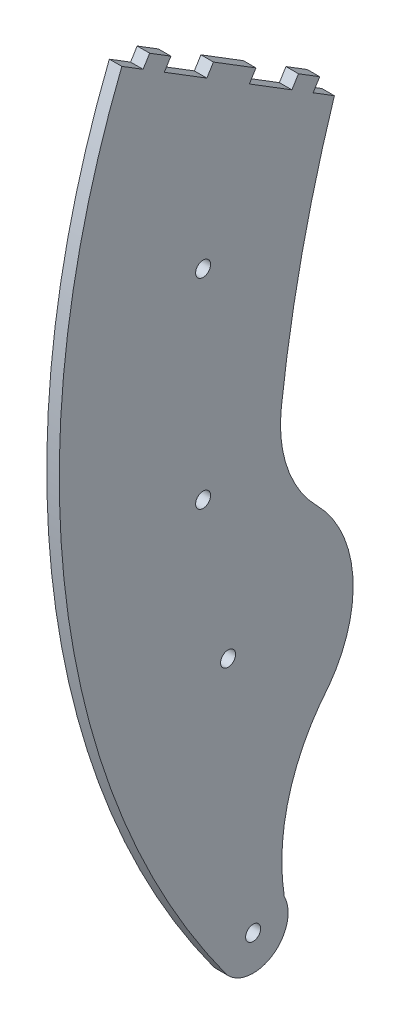
ISO-10303-21;
HEADER;
FILE_DESCRIPTION(('STEP AP214'),'2;1');
FILE_NAME('part.step','',(''),(''),'','','');
FILE_SCHEMA(('AUTOMOTIVE_DESIGN { 1 0 10303 214 1 1 1 1 }'));
ENDSEC;
DATA;
#1=APPLICATION_CONTEXT('core data for automotive mechanical design processes');
#2=APPLICATION_PROTOCOL_DEFINITION('international standard','automotive_design',2000,#1);
#3=PRODUCT_CONTEXT('',#1,'mechanical');
#4=PRODUCT('Part','Part','',(#3));
#5=PRODUCT_RELATED_PRODUCT_CATEGORY('part','',(#4));
#6=PRODUCT_DEFINITION_FORMATION('','',#4);
#7=PRODUCT_DEFINITION_CONTEXT('part definition',#1,'design');
#8=PRODUCT_DEFINITION('design','',#6,#7);
#9=PRODUCT_DEFINITION_SHAPE('','',#8);
#10=(LENGTH_UNIT() NAMED_UNIT(*) SI_UNIT(.MILLI.,.METRE.));
#11=(NAMED_UNIT(*) PLANE_ANGLE_UNIT() SI_UNIT($,.RADIAN.));
#12=(NAMED_UNIT(*) SI_UNIT($,.STERADIAN.) SOLID_ANGLE_UNIT());
#13=UNCERTAINTY_MEASURE_WITH_UNIT(LENGTH_MEASURE(1.E-05),#10,'distance_accuracy_value','');
#14=(GEOMETRIC_REPRESENTATION_CONTEXT(3) GLOBAL_UNCERTAINTY_ASSIGNED_CONTEXT((#13)) GLOBAL_UNIT_ASSIGNED_CONTEXT((#10,
#11,#12)) REPRESENTATION_CONTEXT('',''));
#15=CARTESIAN_POINT('',(0.,0.,0.));
#16=DIRECTION('',(0.,0.,1.));
#17=DIRECTION('',(1.,0.,0.));
#18=AXIS2_PLACEMENT_3D('',#15,#16,#17);
#19=CARTESIAN_POINT('',(2.5,7.3686532794475,-268.81066568157));
#20=DIRECTION('',(1.,0.,0.));
#21=DIRECTION('',(0.,0.,-1.));
#22=AXIS2_PLACEMENT_3D('',#19,#20,#21);
#23=PLANE('',#22);
#24=CARTESIAN_POINT('',(2.5,30.,5.));
#25=DIRECTION('',(1.,0.,0.));
#26=DIRECTION('',(0.,0.,-1.));
#27=AXIS2_PLACEMENT_3D('',#24,#25,#26);
#28=CIRCLE('',#27,1.5);
#29=CARTESIAN_POINT('',(2.5,30.,3.5));
#30=VERTEX_POINT('',#29);
#31=EDGE_CURVE('E382',#30,#30,#28,.T.);
#32=ORIENTED_EDGE('',*,*,#31,.F.);
#33=EDGE_LOOP('',(#32));
#34=FACE_BOUND('',#33,.T.);
#35=CARTESIAN_POINT('',(2.5,-50.,-5.00000000000001));
#36=DIRECTION('',(1.,0.,0.));
#37=DIRECTION('',(0.,0.,-1.));
#38=AXIS2_PLACEMENT_3D('',#35,#36,#37);
#39=CIRCLE('',#38,1.5);
#40=CARTESIAN_POINT('',(2.5,-50.,-6.50000000000001));
#41=VERTEX_POINT('',#40);
#42=EDGE_CURVE('E199',#41,#41,#39,.T.);
#43=ORIENTED_EDGE('',*,*,#42,.F.);
#44=EDGE_LOOP('',(#43));
#45=FACE_BOUND('',#44,.T.);
#46=CARTESIAN_POINT('',(2.5,7.3686532794475,-268.81066568157));
#47=DIRECTION('',(-1.,0.,0.));
#48=DIRECTION('',(0.,0.,-1.));
#49=AXIS2_PLACEMENT_3D('',#46,#47,#48);
#50=CIRCLE('',#49,260.000000000341);
#51=CARTESIAN_POINT('',(2.5,38.2060235623893,-10.6458799453857));
#52=VERTEX_POINT('',#51);
#53=CARTESIAN_POINT('',(2.5,86.8335273900748,-21.2519175372974));
#54=VERTEX_POINT('',#53);
#55=EDGE_CURVE('E232',#52,#54,#50,.T.);
#56=ORIENTED_EDGE('',*,*,#55,.T.);
#57=DIRECTION('',(0.,0.526658904397004,0.850076701491899));
#58=VECTOR('',#57,1.);
#59=CARTESIAN_POINT('',(2.5,86.8335273900748,-21.2519175372974));
#60=LINE('',#59,#58);
#61=CARTESIAN_POINT('',(2.5,89.4668219120599,-17.001534029838));
#62=VERTEX_POINT('',#61);
#63=EDGE_CURVE('E125',#54,#62,#60,.T.);
#64=ORIENTED_EDGE('',*,*,#63,.T.);
#65=DIRECTION('',(0.,0.8500767014919,-0.526658904397003));
#66=VECTOR('',#65,1.);
#67=CARTESIAN_POINT('',(2.5,89.4668219120599,-17.001534029838));
#68=LINE('',#67,#66);
#69=CARTESIAN_POINT('',(2.5,91.5920136657897,-18.3181812908305));
#70=VERTEX_POINT('',#69);
#71=EDGE_CURVE('E280',#62,#70,#68,.T.);
#72=ORIENTED_EDGE('',*,*,#71,.T.);
#73=DIRECTION('',(0.,0.526658904397003,0.8500767014919));
#74=VECTOR('',#73,1.);
#75=CARTESIAN_POINT('',(2.5,94.2253081877747,-14.067797783371));
#76=LINE('',#75,#74);
#77=CARTESIAN_POINT('',(2.5,94.2253081877747,-14.067797783371));
#78=VERTEX_POINT('',#77);
#79=EDGE_CURVE('E299',#70,#78,#76,.T.);
#80=ORIENTED_EDGE('',*,*,#79,.T.);
#81=DIRECTION('',(0.,-0.850076701491899,0.526658904397004));
#82=VECTOR('',#81,1.);
#83=CARTESIAN_POINT('',(2.5,92.1001164340449,-12.7511505223785));
#84=LINE('',#83,#82);
#85=CARTESIAN_POINT('',(2.5,92.1001164340449,-12.7511505223785));
#86=VERTEX_POINT('',#85);
#87=EDGE_CURVE('E296',#78,#86,#84,.T.);
#88=ORIENTED_EDGE('',*,*,#87,.T.);
#89=DIRECTION('',(0.,0.526658904397005,0.850076701491899));
#90=VECTOR('',#89,1.);
#91=CARTESIAN_POINT('',(2.5,97.3667054780149,-4.25038350745946));
#92=LINE('',#91,#90);
#93=CARTESIAN_POINT('',(2.5,97.3667054780149,-4.25038350745946));
#94=VERTEX_POINT('',#93);
#95=EDGE_CURVE('E298',#86,#94,#92,.T.);
#96=ORIENTED_EDGE('',*,*,#95,.T.);
#97=DIRECTION('',(0.,0.850076701491902,-0.526658904396999));
#98=VECTOR('',#97,1.);
#99=CARTESIAN_POINT('',(2.5,99.4918972317447,-5.56703076845199));
#100=LINE('',#99,#98);
#101=CARTESIAN_POINT('',(2.5,99.4918972317447,-5.56703076845199));
#102=VERTEX_POINT('',#101);
#103=EDGE_CURVE('E301',#94,#102,#100,.T.);
#104=ORIENTED_EDGE('',*,*,#103,.T.);
#105=DIRECTION('',(0.,0.526658904397001,0.850076701491901));
#106=VECTOR('',#105,1.);
#107=CARTESIAN_POINT('',(2.5,104.758486275715,2.93373624646701));
#108=LINE('',#107,#106);
#109=CARTESIAN_POINT('',(2.5,104.758486275715,2.93373624646701));
#110=VERTEX_POINT('',#109);
#111=EDGE_CURVE('E307',#102,#110,#108,.T.);
#112=ORIENTED_EDGE('',*,*,#111,.T.);
#113=DIRECTION('',(0.,-0.850076701491901,0.526658904397001));
#114=VECTOR('',#113,1.);
#115=CARTESIAN_POINT('',(2.5,102.633294521985,4.25038350745956));
#116=LINE('',#115,#114);
#117=CARTESIAN_POINT('',(2.5,102.633294521985,4.25038350745956));
#118=VERTEX_POINT('',#117);
#119=EDGE_CURVE('E309',#110,#118,#116,.T.);
#120=ORIENTED_EDGE('',*,*,#119,.T.);
#121=DIRECTION('',(0.,0.526658904397011,0.850076701491895));
#122=VECTOR('',#121,1.);
#123=CARTESIAN_POINT('',(2.5,107.899883565955,12.7511505223785));
#124=LINE('',#123,#122);
#125=CARTESIAN_POINT('',(2.5,107.899883565955,12.7511505223785));
#126=VERTEX_POINT('',#125);
#127=EDGE_CURVE('E311',#118,#126,#124,.T.);
#128=ORIENTED_EDGE('',*,*,#127,.T.);
#129=DIRECTION('',(0.,0.850076701491899,-0.526658904397004));
#130=VECTOR('',#129,1.);
#131=CARTESIAN_POINT('',(2.5,110.025075319685,11.434503261386));
#132=LINE('',#131,#130);
#133=CARTESIAN_POINT('',(2.5,110.025075319685,11.434503261386));
#134=VERTEX_POINT('',#133);
#135=EDGE_CURVE('E313',#126,#134,#132,.T.);
#136=ORIENTED_EDGE('',*,*,#135,.T.);
#137=DIRECTION('',(0.,0.526658904397003,0.8500767014919));
#138=VECTOR('',#137,1.);
#139=CARTESIAN_POINT('',(2.5,112.65836984167,15.6848867688455));
#140=LINE('',#139,#138);
#141=CARTESIAN_POINT('',(2.5,112.65836984167,15.6848867688455));
#142=VERTEX_POINT('',#141);
#143=EDGE_CURVE('E315',#134,#142,#140,.T.);
#144=ORIENTED_EDGE('',*,*,#143,.T.);
#145=DIRECTION('',(0.,-0.850076701491901,0.526658904397002));
#146=VECTOR('',#145,1.);
#147=CARTESIAN_POINT('',(2.5,112.65836984167,15.6848867688455));
#148=LINE('',#147,#146);
#149=CARTESIAN_POINT('',(2.5,110.53317808794,17.0015340298381));
#150=VERTEX_POINT('',#149);
#151=EDGE_CURVE('E317',#142,#150,#148,.T.);
#152=ORIENTED_EDGE('',*,*,#151,.T.);
#153=DIRECTION('',(0.,0.526658904397018,0.85007670149189));
#154=VECTOR('',#153,1.);
#155=CARTESIAN_POINT('',(2.5,110.53317808794,17.0015340298381));
#156=LINE('',#155,#154);
#157=CARTESIAN_POINT('',(2.5,113.166472609925,21.2519175372975));
#158=VERTEX_POINT('',#157);
#159=EDGE_CURVE('E319',#150,#158,#156,.T.);
#160=ORIENTED_EDGE('',*,*,#159,.T.);
#161=CARTESIAN_POINT('',(2.5,48.2447845368499,-140.988008522798));
#162=DIRECTION('',(1.,0.,0.));
#163=DIRECTION('',(0.,0.,-1.));
#164=AXIS2_PLACEMENT_3D('',#161,#162,#163);
#165=CIRCLE('',#164,174.74730095267);
#166=CARTESIAN_POINT('',(2.5,-54.489427017395,0.370758331509985));
#167=VERTEX_POINT('',#166);
#168=EDGE_CURVE('E321',#158,#167,#165,.T.);
#169=ORIENTED_EDGE('',*,*,#168,.T.);
#170=CARTESIAN_POINT('',(2.5,-50.,-5.00000000000001));
#171=DIRECTION('',(1.,0.,0.));
#172=DIRECTION('',(0.,0.,-1.));
#173=AXIS2_PLACEMENT_3D('',#170,#171,#172);
#174=CIRCLE('',#173,7.);
#175=CARTESIAN_POINT('',(2.5,-46.8018864241947,-11.2267222160821));
#176=VERTEX_POINT('',#175);
#177=EDGE_CURVE('E177',#167,#176,#174,.T.);
#178=ORIENTED_EDGE('',*,*,#177,.T.);
#179=CARTESIAN_POINT('',(2.5,-40.5614465144833,-50.7369349430883));
#180=DIRECTION('',(-1.,0.,0.));
#181=DIRECTION('',(0.,0.,-1.));
#182=AXIS2_PLACEMENT_3D('',#179,#180,#181);
#183=CIRCLE('',#182,40.);
#184=CARTESIAN_POINT('',(2.5,-14.7006486764227,-20.2210516168767));
#185=VERTEX_POINT('',#184);
#186=EDGE_CURVE('E171',#176,#185,#183,.T.);
#187=ORIENTED_EDGE('',*,*,#186,.T.);
#188=CARTESIAN_POINT('',(2.5,0.,0.));
#189=DIRECTION('',(1.,0.,0.));
#190=DIRECTION('',(0.,0.,-1.));
#191=AXIS2_PLACEMENT_3D('',#188,#189,#190);
#192=CIRCLE('',#191,25.);
#193=CARTESIAN_POINT('',(2.5,17.6204459022106,-17.7347085176856));
#194=VERTEX_POINT('',#193);
#195=EDGE_CURVE('E175',#185,#194,#192,.T.);
#196=ORIENTED_EDGE('',*,*,#195,.T.);
#197=CARTESIAN_POINT('',(2.5,35.2408918044211,-35.4694170353712));
#198=DIRECTION('',(-1.,0.,0.));
#199=DIRECTION('',(0.,0.,-1.));
#200=AXIS2_PLACEMENT_3D('',#197,#198,#199);
#201=CIRCLE('',#200,25.);
#202=EDGE_CURVE('E49',#194,#52,#201,.T.);
#203=ORIENTED_EDGE('',*,*,#202,.T.);
#204=EDGE_LOOP('',(#56,#64,#72,#80,#88,#96,#104,#112,#120,#128,#136,#144,#152,#160,#169,#178,
#187,#196,#203));
#205=FACE_BOUND('',#204,.T.);
#206=CARTESIAN_POINT('',(2.5,0.,0.));
#207=DIRECTION('',(1.,0.,0.));
#208=DIRECTION('',(0.,0.,-1.));
#209=AXIS2_PLACEMENT_3D('',#206,#207,#208);
#210=CIRCLE('',#209,1.5);
#211=CARTESIAN_POINT('',(2.5,0.,-1.5));
#212=VERTEX_POINT('',#211);
#213=EDGE_CURVE('E388',#212,#212,#210,.T.);
#214=ORIENTED_EDGE('',*,*,#213,.F.);
#215=EDGE_LOOP('',(#214));
#216=FACE_BOUND('',#215,.T.);
#217=CARTESIAN_POINT('',(2.5,70.,5.));
#218=DIRECTION('',(1.,0.,0.));
#219=DIRECTION('',(0.,0.,-1.));
#220=AXIS2_PLACEMENT_3D('',#217,#218,#219);
#221=CIRCLE('',#220,1.5);
#222=CARTESIAN_POINT('',(2.5,70.,3.5));
#223=VERTEX_POINT('',#222);
#224=EDGE_CURVE('E373',#223,#223,#221,.T.);
#225=ORIENTED_EDGE('',*,*,#224,.F.);
#226=EDGE_LOOP('',(#225));
#227=FACE_BOUND('',#226,.T.);
#228=ADVANCED_FACE('F32',(#34,#45,#205,#216,#227),#23,.T.);
#229=CARTESIAN_POINT('',(0.,7.3686532794475,-268.81066568157));
#230=DIRECTION('',(1.,0.,0.));
#231=DIRECTION('',(0.,0.,-1.));
#232=AXIS2_PLACEMENT_3D('',#229,#230,#231);
#233=PLANE('',#232);
#234=CARTESIAN_POINT('',(0.,30.,5.));
#235=DIRECTION('',(1.,0.,0.));
#236=DIRECTION('',(0.,0.,-1.));
#237=AXIS2_PLACEMENT_3D('',#234,#235,#236);
#238=CIRCLE('',#237,1.5);
#239=CARTESIAN_POINT('',(0.,30.,3.5));
#240=VERTEX_POINT('',#239);
#241=EDGE_CURVE('E379',#240,#240,#238,.T.);
#242=ORIENTED_EDGE('',*,*,#241,.T.);
#243=EDGE_LOOP('',(#242));
#244=FACE_BOUND('',#243,.T.);
#245=CARTESIAN_POINT('',(0.,-50.,-5.00000000000001));
#246=DIRECTION('',(1.,0.,0.));
#247=DIRECTION('',(0.,0.,-1.));
#248=AXIS2_PLACEMENT_3D('',#245,#246,#247);
#249=CIRCLE('',#248,1.5);
#250=CARTESIAN_POINT('',(0.,-50.,-6.50000000000001));
#251=VERTEX_POINT('',#250);
#252=EDGE_CURVE('E391',#251,#251,#249,.T.);
#253=ORIENTED_EDGE('',*,*,#252,.T.);
#254=EDGE_LOOP('',(#253));
#255=FACE_BOUND('',#254,.T.);
#256=CARTESIAN_POINT('',(0.,7.3686532794475,-268.81066568157));
#257=DIRECTION('',(-1.,0.,0.));
#258=DIRECTION('',(0.,0.,-1.));
#259=AXIS2_PLACEMENT_3D('',#256,#257,#258);
#260=CIRCLE('',#259,260.000000000341);
#261=CARTESIAN_POINT('',(0.,38.2060235623893,-10.6458799453857));
#262=VERTEX_POINT('',#261);
#263=CARTESIAN_POINT('',(0.,86.8335273900748,-21.2519175372974));
#264=VERTEX_POINT('',#263);
#265=EDGE_CURVE('E195',#262,#264,#260,.T.);
#266=ORIENTED_EDGE('',*,*,#265,.F.);
#267=CARTESIAN_POINT('',(0.,35.2408918044211,-35.4694170353712));
#268=DIRECTION('',(-1.,0.,0.));
#269=DIRECTION('',(0.,0.,-1.));
#270=AXIS2_PLACEMENT_3D('',#267,#268,#269);
#271=CIRCLE('',#270,25.);
#272=CARTESIAN_POINT('',(0.,17.6204459022106,-17.7347085176856));
#273=VERTEX_POINT('',#272);
#274=EDGE_CURVE('E117',#273,#262,#271,.T.);
#275=ORIENTED_EDGE('',*,*,#274,.F.);
#276=CARTESIAN_POINT('',(0.,0.,0.));
#277=DIRECTION('',(1.,0.,0.));
#278=DIRECTION('',(0.,0.,-1.));
#279=AXIS2_PLACEMENT_3D('',#276,#277,#278);
#280=CIRCLE('',#279,25.);
#281=CARTESIAN_POINT('',(0.,-14.7006486764227,-20.2210516168767));
#282=VERTEX_POINT('',#281);
#283=EDGE_CURVE('E111',#282,#273,#280,.T.);
#284=ORIENTED_EDGE('',*,*,#283,.F.);
#285=CARTESIAN_POINT('',(0.,-40.5614465144833,-50.7369349430883));
#286=DIRECTION('',(-1.,0.,0.));
#287=DIRECTION('',(0.,0.,-1.));
#288=AXIS2_PLACEMENT_3D('',#285,#286,#287);
#289=CIRCLE('',#288,40.);
#290=CARTESIAN_POINT('',(0.,-46.8018864241947,-11.2267222160821));
#291=VERTEX_POINT('',#290);
#292=EDGE_CURVE('E185',#291,#282,#289,.T.);
#293=ORIENTED_EDGE('',*,*,#292,.F.);
#294=CARTESIAN_POINT('',(0.,-50.,-5.00000000000001));
#295=DIRECTION('',(1.,0.,0.));
#296=DIRECTION('',(0.,0.,-1.));
#297=AXIS2_PLACEMENT_3D('',#294,#295,#296);
#298=CIRCLE('',#297,7.);
#299=CARTESIAN_POINT('',(0.,-54.489427017395,0.370758331509985));
#300=VERTEX_POINT('',#299);
#301=EDGE_CURVE('E227',#300,#291,#298,.T.);
#302=ORIENTED_EDGE('',*,*,#301,.F.);
#303=CARTESIAN_POINT('',(0.,48.2447845368499,-140.988008522798));
#304=DIRECTION('',(1.,0.,0.));
#305=DIRECTION('',(0.,0.,-1.));
#306=AXIS2_PLACEMENT_3D('',#303,#304,#305);
#307=CIRCLE('',#306,174.74730095267);
#308=CARTESIAN_POINT('',(0.,113.166472609925,21.2519175372975));
#309=VERTEX_POINT('',#308);
#310=EDGE_CURVE('E225',#309,#300,#307,.T.);
#311=ORIENTED_EDGE('',*,*,#310,.F.);
#312=DIRECTION('',(0.,0.526658904397018,0.85007670149189));
#313=VECTOR('',#312,1.);
#314=CARTESIAN_POINT('',(0.,110.53317808794,17.0015340298381));
#315=LINE('',#314,#313);
#316=CARTESIAN_POINT('',(0.,110.53317808794,17.0015340298381));
#317=VERTEX_POINT('',#316);
#318=EDGE_CURVE('E223',#317,#309,#315,.T.);
#319=ORIENTED_EDGE('',*,*,#318,.F.);
#320=DIRECTION('',(0.,-0.850076701491901,0.526658904397002));
#321=VECTOR('',#320,1.);
#322=CARTESIAN_POINT('',(0.,112.65836984167,15.6848867688455));
#323=LINE('',#322,#321);
#324=CARTESIAN_POINT('',(0.,112.65836984167,15.6848867688455));
#325=VERTEX_POINT('',#324);
#326=EDGE_CURVE('E221',#325,#317,#323,.T.);
#327=ORIENTED_EDGE('',*,*,#326,.F.);
#328=DIRECTION('',(0.,0.526658904397003,0.8500767014919));
#329=VECTOR('',#328,1.);
#330=CARTESIAN_POINT('',(0.,112.65836984167,15.6848867688455));
#331=LINE('',#330,#329);
#332=CARTESIAN_POINT('',(0.,110.025075319685,11.434503261386));
#333=VERTEX_POINT('',#332);
#334=EDGE_CURVE('E219',#333,#325,#331,.T.);
#335=ORIENTED_EDGE('',*,*,#334,.F.);
#336=DIRECTION('',(0.,0.850076701491899,-0.526658904397004));
#337=VECTOR('',#336,1.);
#338=CARTESIAN_POINT('',(0.,110.025075319685,11.434503261386));
#339=LINE('',#338,#337);
#340=CARTESIAN_POINT('',(0.,107.899883565955,12.7511505223785));
#341=VERTEX_POINT('',#340);
#342=EDGE_CURVE('E217',#341,#333,#339,.T.);
#343=ORIENTED_EDGE('',*,*,#342,.F.);
#344=DIRECTION('',(0.,0.526658904397011,0.850076701491895));
#345=VECTOR('',#344,1.);
#346=CARTESIAN_POINT('',(0.,107.899883565955,12.7511505223785));
#347=LINE('',#346,#345);
#348=CARTESIAN_POINT('',(0.,102.633294521985,4.25038350745956));
#349=VERTEX_POINT('',#348);
#350=EDGE_CURVE('E215',#349,#341,#347,.T.);
#351=ORIENTED_EDGE('',*,*,#350,.F.);
#352=DIRECTION('',(0.,-0.850076701491901,0.526658904397001));
#353=VECTOR('',#352,1.);
#354=CARTESIAN_POINT('',(0.,102.633294521985,4.25038350745956));
#355=LINE('',#354,#353);
#356=CARTESIAN_POINT('',(0.,104.758486275715,2.93373624646701));
#357=VERTEX_POINT('',#356);
#358=EDGE_CURVE('E213',#357,#349,#355,.T.);
#359=ORIENTED_EDGE('',*,*,#358,.F.);
#360=DIRECTION('',(0.,0.526658904397001,0.850076701491901));
#361=VECTOR('',#360,1.);
#362=CARTESIAN_POINT('',(0.,104.758486275715,2.93373624646701));
#363=LINE('',#362,#361);
#364=CARTESIAN_POINT('',(0.,99.4918972317447,-5.56703076845199));
#365=VERTEX_POINT('',#364);
#366=EDGE_CURVE('E211',#365,#357,#363,.T.);
#367=ORIENTED_EDGE('',*,*,#366,.F.);
#368=DIRECTION('',(0.,0.850076701491902,-0.526658904396999));
#369=VECTOR('',#368,1.);
#370=CARTESIAN_POINT('',(0.,99.4918972317447,-5.56703076845199));
#371=LINE('',#370,#369);
#372=CARTESIAN_POINT('',(0.,97.3667054780149,-4.25038350745946));
#373=VERTEX_POINT('',#372);
#374=EDGE_CURVE('E209',#373,#365,#371,.T.);
#375=ORIENTED_EDGE('',*,*,#374,.F.);
#376=DIRECTION('',(0.,0.526658904397005,0.850076701491899));
#377=VECTOR('',#376,1.);
#378=CARTESIAN_POINT('',(0.,97.3667054780149,-4.25038350745946));
#379=LINE('',#378,#377);
#380=CARTESIAN_POINT('',(0.,92.1001164340449,-12.7511505223785));
#381=VERTEX_POINT('',#380);
#382=EDGE_CURVE('E207',#381,#373,#379,.T.);
#383=ORIENTED_EDGE('',*,*,#382,.F.);
#384=DIRECTION('',(0.,-0.850076701491899,0.526658904397004));
#385=VECTOR('',#384,1.);
#386=CARTESIAN_POINT('',(0.,92.1001164340449,-12.7511505223785));
#387=LINE('',#386,#385);
#388=CARTESIAN_POINT('',(0.,94.2253081877747,-14.067797783371));
#389=VERTEX_POINT('',#388);
#390=EDGE_CURVE('E205',#389,#381,#387,.T.);
#391=ORIENTED_EDGE('',*,*,#390,.F.);
#392=DIRECTION('',(0.,0.526658904397003,0.8500767014919));
#393=VECTOR('',#392,1.);
#394=CARTESIAN_POINT('',(0.,94.2253081877747,-14.067797783371));
#395=LINE('',#394,#393);
#396=CARTESIAN_POINT('',(0.,91.5920136657897,-18.3181812908305));
#397=VERTEX_POINT('',#396);
#398=EDGE_CURVE('E203',#397,#389,#395,.T.);
#399=ORIENTED_EDGE('',*,*,#398,.F.);
#400=DIRECTION('',(0.,0.8500767014919,-0.526658904397003));
#401=VECTOR('',#400,1.);
#402=CARTESIAN_POINT('',(0.,89.4668219120599,-17.001534029838));
#403=LINE('',#402,#401);
#404=CARTESIAN_POINT('',(0.,89.4668219120599,-17.001534029838));
#405=VERTEX_POINT('',#404);
#406=EDGE_CURVE('E201',#405,#397,#403,.T.);
#407=ORIENTED_EDGE('',*,*,#406,.F.);
#408=DIRECTION('',(0.,0.526658904397004,0.850076701491899));
#409=VECTOR('',#408,1.);
#410=CARTESIAN_POINT('',(0.,86.8335273900748,-21.2519175372974));
#411=LINE('',#410,#409);
#412=EDGE_CURVE('E198',#264,#405,#411,.T.);
#413=ORIENTED_EDGE('',*,*,#412,.F.);
#414=EDGE_LOOP('',(#266,#275,#284,#293,#302,#311,#319,#327,#335,#343,#351,#359,#367,#375,#383,
#391,#399,#407,#413));
#415=FACE_BOUND('',#414,.T.);
#416=CARTESIAN_POINT('',(0.,0.,0.));
#417=DIRECTION('',(1.,0.,0.));
#418=DIRECTION('',(0.,0.,-1.));
#419=AXIS2_PLACEMENT_3D('',#416,#417,#418);
#420=CIRCLE('',#419,1.5);
#421=CARTESIAN_POINT('',(0.,0.,-1.5));
#422=VERTEX_POINT('',#421);
#423=EDGE_CURVE('E385',#422,#422,#420,.T.);
#424=ORIENTED_EDGE('',*,*,#423,.T.);
#425=EDGE_LOOP('',(#424));
#426=FACE_BOUND('',#425,.T.);
#427=CARTESIAN_POINT('',(0.,70.,5.));
#428=DIRECTION('',(1.,0.,0.));
#429=DIRECTION('',(0.,0.,-1.));
#430=AXIS2_PLACEMENT_3D('',#427,#428,#429);
#431=CIRCLE('',#430,1.5);
#432=CARTESIAN_POINT('',(0.,70.,3.5));
#433=VERTEX_POINT('',#432);
#434=EDGE_CURVE('E376',#433,#433,#431,.T.);
#435=ORIENTED_EDGE('',*,*,#434,.T.);
#436=EDGE_LOOP('',(#435));
#437=FACE_BOUND('',#436,.T.);
#438=ADVANCED_FACE('F284',(#244,#255,#415,#426,#437),#233,.F.);
#439=CARTESIAN_POINT('',(2.5,7.3686532794475,-268.81066568157));
#440=DIRECTION('',(-1.,0.,0.));
#441=DIRECTION('',(0.,0.,1.));
#442=AXIS2_PLACEMENT_3D('',#439,#440,#441);
#443=CYLINDRICAL_SURFACE('',#442,260.000000000341);
#444=ORIENTED_EDGE('',*,*,#265,.T.);
#445=DIRECTION('',(-1.,0.,0.));
#446=VECTOR('',#445,1.);
#447=CARTESIAN_POINT('',(2.5,86.8335273900748,-21.2519175372974));
#448=LINE('',#447,#446);
#449=EDGE_CURVE('E11',#54,#264,#448,.T.);
#450=ORIENTED_EDGE('',*,*,#449,.F.);
#451=ORIENTED_EDGE('',*,*,#55,.F.);
#452=DIRECTION('',(-1.,0.,0.));
#453=VECTOR('',#452,1.);
#454=CARTESIAN_POINT('',(2.5,38.2060235623893,-10.6458799453857));
#455=LINE('',#454,#453);
#456=EDGE_CURVE('E191',#52,#262,#455,.T.);
#457=ORIENTED_EDGE('',*,*,#456,.T.);
#458=EDGE_LOOP('',(#444,#450,#451,#457));
#459=FACE_BOUND('',#458,.T.);
#460=ADVANCED_FACE('F34',(#459),#443,.F.);
#461=CARTESIAN_POINT('',(2.5,86.8335273900748,-21.2519175372974));
#462=DIRECTION('',(0.,-0.850076701491899,0.526658904397004));
#463=DIRECTION('',(0.,-0.526658904397004,-0.850076701491899));
#464=AXIS2_PLACEMENT_3D('',#461,#462,#463);
#465=PLANE('',#464);
#466=ORIENTED_EDGE('',*,*,#412,.T.);
#467=DIRECTION('',(-1.,0.,0.));
#468=VECTOR('',#467,1.);
#469=CARTESIAN_POINT('',(2.5,89.4668219120599,-17.001534029838));
#470=LINE('',#469,#468);
#471=EDGE_CURVE('E41',#62,#405,#470,.T.);
#472=ORIENTED_EDGE('',*,*,#471,.F.);
#473=ORIENTED_EDGE('',*,*,#63,.F.);
#474=ORIENTED_EDGE('',*,*,#449,.T.);
#475=EDGE_LOOP('',(#466,#472,#473,#474));
#476=FACE_BOUND('',#475,.T.);
#477=ADVANCED_FACE('F570',(#476),#465,.F.);
#478=CARTESIAN_POINT('',(2.5,89.4668219120599,-17.001534029838));
#479=DIRECTION('',(0.,0.526658904397003,0.8500767014919));
#480=DIRECTION('',(0.,-0.8500767014919,0.526658904397003));
#481=AXIS2_PLACEMENT_3D('',#478,#479,#480);
#482=PLANE('',#481);
#483=ORIENTED_EDGE('',*,*,#406,.T.);
#484=DIRECTION('',(-1.,0.,0.));
#485=VECTOR('',#484,1.);
#486=CARTESIAN_POINT('',(2.5,91.5920136657897,-18.3181812908305));
#487=LINE('',#486,#485);
#488=EDGE_CURVE('E272',#70,#397,#487,.T.);
#489=ORIENTED_EDGE('',*,*,#488,.F.);
#490=ORIENTED_EDGE('',*,*,#71,.F.);
#491=ORIENTED_EDGE('',*,*,#471,.T.);
#492=EDGE_LOOP('',(#483,#489,#490,#491));
#493=FACE_BOUND('',#492,.T.);
#494=ADVANCED_FACE('F278',(#493),#482,.F.);
#495=CARTESIAN_POINT('',(2.5,94.2253081877747,-14.067797783371));
#496=DIRECTION('',(0.,-0.8500767014919,0.526658904397003));
#497=DIRECTION('',(0.,-0.526658904397003,-0.8500767014919));
#498=AXIS2_PLACEMENT_3D('',#495,#496,#497);
#499=PLANE('',#498);
#500=ORIENTED_EDGE('',*,*,#398,.T.);
#501=DIRECTION('',(-1.,0.,0.));
#502=VECTOR('',#501,1.);
#503=CARTESIAN_POINT('',(2.5,94.2253081877747,-14.067797783371));
#504=LINE('',#503,#502);
#505=EDGE_CURVE('E269',#78,#389,#504,.T.);
#506=ORIENTED_EDGE('',*,*,#505,.F.);
#507=ORIENTED_EDGE('',*,*,#79,.F.);
#508=ORIENTED_EDGE('',*,*,#488,.T.);
#509=EDGE_LOOP('',(#500,#506,#507,#508));
#510=FACE_BOUND('',#509,.T.);
#511=ADVANCED_FACE('F290',(#510),#499,.F.);
#512=CARTESIAN_POINT('',(2.5,92.1001164340449,-12.7511505223785));
#513=DIRECTION('',(0.,-0.526658904397004,-0.850076701491899));
#514=DIRECTION('',(0.,0.850076701491899,-0.526658904397004));
#515=AXIS2_PLACEMENT_3D('',#512,#513,#514);
#516=PLANE('',#515);
#517=ORIENTED_EDGE('',*,*,#390,.T.);
#518=DIRECTION('',(-1.,0.,0.));
#519=VECTOR('',#518,1.);
#520=CARTESIAN_POINT('',(2.5,92.1001164340449,-12.7511505223785));
#521=LINE('',#520,#519);
#522=EDGE_CURVE('E266',#86,#381,#521,.T.);
#523=ORIENTED_EDGE('',*,*,#522,.F.);
#524=ORIENTED_EDGE('',*,*,#87,.F.);
#525=ORIENTED_EDGE('',*,*,#505,.T.);
#526=EDGE_LOOP('',(#517,#523,#524,#525));
#527=FACE_BOUND('',#526,.T.);
#528=ADVANCED_FACE('F294',(#527),#516,.F.);
#529=CARTESIAN_POINT('',(2.5,97.3667054780149,-4.25038350745946));
#530=DIRECTION('',(0.,-0.850076701491899,0.526658904397005));
#531=DIRECTION('',(0.,-0.526658904397005,-0.850076701491899));
#532=AXIS2_PLACEMENT_3D('',#529,#530,#531);
#533=PLANE('',#532);
#534=ORIENTED_EDGE('',*,*,#382,.T.);
#535=DIRECTION('',(-1.,0.,0.));
#536=VECTOR('',#535,1.);
#537=CARTESIAN_POINT('',(2.5,97.3667054780149,-4.25038350745946));
#538=LINE('',#537,#536);
#539=EDGE_CURVE('E263',#94,#373,#538,.T.);
#540=ORIENTED_EDGE('',*,*,#539,.F.);
#541=ORIENTED_EDGE('',*,*,#95,.F.);
#542=ORIENTED_EDGE('',*,*,#522,.T.);
#543=EDGE_LOOP('',(#534,#540,#541,#542));
#544=FACE_BOUND('',#543,.T.);
#545=ADVANCED_FACE('F535',(#544),#533,.F.);
#546=CARTESIAN_POINT('',(2.5,99.4918972317447,-5.56703076845199));
#547=DIRECTION('',(0.,0.526658904396999,0.850076701491902));
#548=DIRECTION('',(0.,-0.850076701491902,0.526658904396999));
#549=AXIS2_PLACEMENT_3D('',#546,#547,#548);
#550=PLANE('',#549);
#551=ORIENTED_EDGE('',*,*,#374,.T.);
#552=DIRECTION('',(-1.,0.,0.));
#553=VECTOR('',#552,1.);
#554=CARTESIAN_POINT('',(2.5,99.4918972317447,-5.56703076845199));
#555=LINE('',#554,#553);
#556=EDGE_CURVE('E260',#102,#365,#555,.T.);
#557=ORIENTED_EDGE('',*,*,#556,.F.);
#558=ORIENTED_EDGE('',*,*,#103,.F.);
#559=ORIENTED_EDGE('',*,*,#539,.T.);
#560=EDGE_LOOP('',(#551,#557,#558,#559));
#561=FACE_BOUND('',#560,.T.);
#562=ADVANCED_FACE('F525',(#561),#550,.F.);
#563=CARTESIAN_POINT('',(2.5,104.758486275715,2.93373624646701));
#564=DIRECTION('',(0.,-0.850076701491901,0.526658904397001));
#565=DIRECTION('',(0.,-0.526658904397002,-0.850076701491901));
#566=AXIS2_PLACEMENT_3D('',#563,#564,#565);
#567=PLANE('',#566);
#568=ORIENTED_EDGE('',*,*,#366,.T.);
#569=DIRECTION('',(-1.,0.,0.));
#570=VECTOR('',#569,1.);
#571=CARTESIAN_POINT('',(2.5,104.758486275715,2.93373624646701));
#572=LINE('',#571,#570);
#573=EDGE_CURVE('E257',#110,#357,#572,.T.);
#574=ORIENTED_EDGE('',*,*,#573,.F.);
#575=ORIENTED_EDGE('',*,*,#111,.F.);
#576=ORIENTED_EDGE('',*,*,#556,.T.);
#577=EDGE_LOOP('',(#568,#574,#575,#576));
#578=FACE_BOUND('',#577,.T.);
#579=ADVANCED_FACE('F515',(#578),#567,.F.);
#580=CARTESIAN_POINT('',(2.5,102.633294521985,4.25038350745956));
#581=DIRECTION('',(0.,-0.526658904397,-0.850076701491901));
#582=DIRECTION('',(0.,0.850076701491901,-0.526658904397));
#583=AXIS2_PLACEMENT_3D('',#580,#581,#582);
#584=PLANE('',#583);
#585=ORIENTED_EDGE('',*,*,#358,.T.);
#586=DIRECTION('',(-1.,0.,0.));
#587=VECTOR('',#586,1.);
#588=CARTESIAN_POINT('',(2.5,102.633294521985,4.25038350745956));
#589=LINE('',#588,#587);
#590=EDGE_CURVE('E254',#118,#349,#589,.T.);
#591=ORIENTED_EDGE('',*,*,#590,.F.);
#592=ORIENTED_EDGE('',*,*,#119,.F.);
#593=ORIENTED_EDGE('',*,*,#573,.T.);
#594=EDGE_LOOP('',(#585,#591,#592,#593));
#595=FACE_BOUND('',#594,.T.);
#596=ADVANCED_FACE('F505',(#595),#584,.F.);
#597=CARTESIAN_POINT('',(2.5,107.899883565955,12.7511505223785));
#598=DIRECTION('',(0.,-0.850076701491895,0.526658904397011));
#599=DIRECTION('',(0.,-0.526658904397011,-0.850076701491895));
#600=AXIS2_PLACEMENT_3D('',#597,#598,#599);
#601=PLANE('',#600);
#602=ORIENTED_EDGE('',*,*,#350,.T.);
#603=DIRECTION('',(-1.,0.,0.));
#604=VECTOR('',#603,1.);
#605=CARTESIAN_POINT('',(2.5,107.899883565955,12.7511505223785));
#606=LINE('',#605,#604);
#607=EDGE_CURVE('E251',#126,#341,#606,.T.);
#608=ORIENTED_EDGE('',*,*,#607,.F.);
#609=ORIENTED_EDGE('',*,*,#127,.F.);
#610=ORIENTED_EDGE('',*,*,#590,.T.);
#611=EDGE_LOOP('',(#602,#608,#609,#610));
#612=FACE_BOUND('',#611,.T.);
#613=ADVANCED_FACE('F495',(#612),#601,.F.);
#614=CARTESIAN_POINT('',(2.5,110.025075319685,11.434503261386));
#615=DIRECTION('',(0.,0.526658904397004,0.850076701491899));
#616=DIRECTION('',(0.,-0.850076701491899,0.526658904397004));
#617=AXIS2_PLACEMENT_3D('',#614,#615,#616);
#618=PLANE('',#617);
#619=ORIENTED_EDGE('',*,*,#342,.T.);
#620=DIRECTION('',(-1.,0.,0.));
#621=VECTOR('',#620,1.);
#622=CARTESIAN_POINT('',(2.5,110.025075319685,11.434503261386));
#623=LINE('',#622,#621);
#624=EDGE_CURVE('E248',#134,#333,#623,.T.);
#625=ORIENTED_EDGE('',*,*,#624,.F.);
#626=ORIENTED_EDGE('',*,*,#135,.F.);
#627=ORIENTED_EDGE('',*,*,#607,.T.);
#628=EDGE_LOOP('',(#619,#625,#626,#627));
#629=FACE_BOUND('',#628,.T.);
#630=ADVANCED_FACE('F485',(#629),#618,.F.);
#631=CARTESIAN_POINT('',(2.5,112.65836984167,15.6848867688455));
#632=DIRECTION('',(0.,-0.8500767014919,0.526658904397003));
#633=DIRECTION('',(0.,-0.526658904397003,-0.8500767014919));
#634=AXIS2_PLACEMENT_3D('',#631,#632,#633);
#635=PLANE('',#634);
#636=ORIENTED_EDGE('',*,*,#334,.T.);
#637=DIRECTION('',(-1.,0.,0.));
#638=VECTOR('',#637,1.);
#639=CARTESIAN_POINT('',(2.5,112.65836984167,15.6848867688455));
#640=LINE('',#639,#638);
#641=EDGE_CURVE('E245',#142,#325,#640,.T.);
#642=ORIENTED_EDGE('',*,*,#641,.F.);
#643=ORIENTED_EDGE('',*,*,#143,.F.);
#644=ORIENTED_EDGE('',*,*,#624,.T.);
#645=EDGE_LOOP('',(#636,#642,#643,#644));
#646=FACE_BOUND('',#645,.T.);
#647=ADVANCED_FACE('F475',(#646),#635,.F.);
#648=CARTESIAN_POINT('',(2.5,112.65836984167,15.6848867688455));
#649=DIRECTION('',(0.,-0.526658904397002,-0.850076701491901));
#650=DIRECTION('',(0.,0.850076701491901,-0.526658904397002));
#651=AXIS2_PLACEMENT_3D('',#648,#649,#650);
#652=PLANE('',#651);
#653=ORIENTED_EDGE('',*,*,#326,.T.);
#654=DIRECTION('',(-1.,0.,0.));
#655=VECTOR('',#654,1.);
#656=CARTESIAN_POINT('',(2.5,110.53317808794,17.0015340298381));
#657=LINE('',#656,#655);
#658=EDGE_CURVE('E242',#150,#317,#657,.T.);
#659=ORIENTED_EDGE('',*,*,#658,.F.);
#660=ORIENTED_EDGE('',*,*,#151,.F.);
#661=ORIENTED_EDGE('',*,*,#641,.T.);
#662=EDGE_LOOP('',(#653,#659,#660,#661));
#663=FACE_BOUND('',#662,.T.);
#664=ADVANCED_FACE('F465',(#663),#652,.F.);
#665=CARTESIAN_POINT('',(2.5,110.53317808794,17.0015340298381));
#666=DIRECTION('',(0.,-0.85007670149189,0.526658904397018));
#667=DIRECTION('',(0.,-0.526658904397018,-0.85007670149189));
#668=AXIS2_PLACEMENT_3D('',#665,#666,#667);
#669=PLANE('',#668);
#670=ORIENTED_EDGE('',*,*,#318,.T.);
#671=DIRECTION('',(-1.,0.,0.));
#672=VECTOR('',#671,1.);
#673=CARTESIAN_POINT('',(2.5,113.166472609925,21.2519175372975));
#674=LINE('',#673,#672);
#675=EDGE_CURVE('E239',#158,#309,#674,.T.);
#676=ORIENTED_EDGE('',*,*,#675,.F.);
#677=ORIENTED_EDGE('',*,*,#159,.F.);
#678=ORIENTED_EDGE('',*,*,#658,.T.);
#679=EDGE_LOOP('',(#670,#676,#677,#678));
#680=FACE_BOUND('',#679,.T.);
#681=ADVANCED_FACE('F456',(#680),#669,.F.);
#682=CARTESIAN_POINT('',(2.5,48.2447845368499,-140.988008522798));
#683=DIRECTION('',(-1.,0.,0.));
#684=DIRECTION('',(0.,0.,1.));
#685=AXIS2_PLACEMENT_3D('',#682,#683,#684);
#686=CYLINDRICAL_SURFACE('',#685,174.74730095267);
#687=ORIENTED_EDGE('',*,*,#310,.T.);
#688=DIRECTION('',(-1.,0.,0.));
#689=VECTOR('',#688,1.);
#690=CARTESIAN_POINT('',(2.5,-54.489427017395,0.370758331509985));
#691=LINE('',#690,#689);
#692=EDGE_CURVE('E236',#167,#300,#691,.T.);
#693=ORIENTED_EDGE('',*,*,#692,.F.);
#694=ORIENTED_EDGE('',*,*,#168,.F.);
#695=ORIENTED_EDGE('',*,*,#675,.T.);
#696=EDGE_LOOP('',(#687,#693,#694,#695));
#697=FACE_BOUND('',#696,.T.);
#698=ADVANCED_FACE('F327',(#697),#686,.T.);
#699=CARTESIAN_POINT('',(2.5,-50.,-5.00000000000001));
#700=DIRECTION('',(-1.,0.,0.));
#701=DIRECTION('',(0.,0.,1.));
#702=AXIS2_PLACEMENT_3D('',#699,#700,#701);
#703=CYLINDRICAL_SURFACE('',#702,7.);
#704=ORIENTED_EDGE('',*,*,#301,.T.);
#705=DIRECTION('',(-1.,0.,0.));
#706=VECTOR('',#705,1.);
#707=CARTESIAN_POINT('',(2.5,-46.8018864241947,-11.2267222160821));
#708=LINE('',#707,#706);
#709=EDGE_CURVE('E186',#176,#291,#708,.T.);
#710=ORIENTED_EDGE('',*,*,#709,.F.);
#711=ORIENTED_EDGE('',*,*,#177,.F.);
#712=ORIENTED_EDGE('',*,*,#692,.T.);
#713=EDGE_LOOP('',(#704,#710,#711,#712));
#714=FACE_BOUND('',#713,.T.);
#715=ADVANCED_FACE('F331',(#714),#703,.T.);
#716=CARTESIAN_POINT('',(2.5,-40.5614465144833,-50.7369349430883));
#717=DIRECTION('',(-1.,0.,0.));
#718=DIRECTION('',(0.,0.,1.));
#719=AXIS2_PLACEMENT_3D('',#716,#717,#718);
#720=CYLINDRICAL_SURFACE('',#719,40.);
#721=ORIENTED_EDGE('',*,*,#292,.T.);
#722=DIRECTION('',(-1.,0.,0.));
#723=VECTOR('',#722,1.);
#724=CARTESIAN_POINT('',(2.5,-14.7006486764227,-20.2210516168767));
#725=LINE('',#724,#723);
#726=EDGE_CURVE('E182',#185,#282,#725,.T.);
#727=ORIENTED_EDGE('',*,*,#726,.F.);
#728=ORIENTED_EDGE('',*,*,#186,.F.);
#729=ORIENTED_EDGE('',*,*,#709,.T.);
#730=EDGE_LOOP('',(#721,#727,#728,#729));
#731=FACE_BOUND('',#730,.T.);
#732=ADVANCED_FACE('F183',(#731),#720,.F.);
#733=CARTESIAN_POINT('',(2.5,0.,0.));
#734=DIRECTION('',(-1.,0.,0.));
#735=DIRECTION('',(0.,0.,1.));
#736=AXIS2_PLACEMENT_3D('',#733,#734,#735);
#737=CYLINDRICAL_SURFACE('',#736,25.);
#738=ORIENTED_EDGE('',*,*,#283,.T.);
#739=DIRECTION('',(-1.,0.,0.));
#740=VECTOR('',#739,1.);
#741=CARTESIAN_POINT('',(2.5,17.6204459022106,-17.7347085176856));
#742=LINE('',#741,#740);
#743=EDGE_CURVE('E187',#194,#273,#742,.T.);
#744=ORIENTED_EDGE('',*,*,#743,.F.);
#745=ORIENTED_EDGE('',*,*,#195,.F.);
#746=ORIENTED_EDGE('',*,*,#726,.T.);
#747=EDGE_LOOP('',(#738,#744,#745,#746));
#748=FACE_BOUND('',#747,.T.);
#749=ADVANCED_FACE('F189',(#748),#737,.T.);
#750=CARTESIAN_POINT('',(2.5,35.2408918044211,-35.4694170353712));
#751=DIRECTION('',(-1.,0.,0.));
#752=DIRECTION('',(0.,0.,1.));
#753=AXIS2_PLACEMENT_3D('',#750,#751,#752);
#754=CYLINDRICAL_SURFACE('',#753,25.);
#755=ORIENTED_EDGE('',*,*,#274,.T.);
#756=ORIENTED_EDGE('',*,*,#456,.F.);
#757=ORIENTED_EDGE('',*,*,#202,.F.);
#758=ORIENTED_EDGE('',*,*,#743,.T.);
#759=EDGE_LOOP('',(#755,#756,#757,#758));
#760=FACE_BOUND('',#759,.T.);
#761=ADVANCED_FACE('F335',(#760),#754,.F.);
#762=CARTESIAN_POINT('',(2.5,-50.,-5.00000000000001));
#763=DIRECTION('',(-1.,0.,0.));
#764=DIRECTION('',(0.,0.,1.));
#765=AXIS2_PLACEMENT_3D('',#762,#763,#764);
#766=CYLINDRICAL_SURFACE('',#765,1.5);
#767=ORIENTED_EDGE('',*,*,#42,.T.);
#768=EDGE_LOOP('',(#767));
#769=FACE_BOUND('',#768,.T.);
#770=ORIENTED_EDGE('',*,*,#252,.F.);
#771=EDGE_LOOP('',(#770));
#772=FACE_BOUND('',#771,.T.);
#773=ADVANCED_FACE('F337',(#769,#772),#766,.F.);
#774=CARTESIAN_POINT('',(2.5,0.,0.));
#775=DIRECTION('',(-1.,0.,0.));
#776=DIRECTION('',(0.,0.,1.));
#777=AXIS2_PLACEMENT_3D('',#774,#775,#776);
#778=CYLINDRICAL_SURFACE('',#777,1.5);
#779=ORIENTED_EDGE('',*,*,#213,.T.);
#780=EDGE_LOOP('',(#779));
#781=FACE_BOUND('',#780,.T.);
#782=ORIENTED_EDGE('',*,*,#423,.F.);
#783=EDGE_LOOP('',(#782));
#784=FACE_BOUND('',#783,.T.);
#785=ADVANCED_FACE('F343',(#781,#784),#778,.F.);
#786=CARTESIAN_POINT('',(2.5,30.,5.));
#787=DIRECTION('',(-1.,0.,0.));
#788=DIRECTION('',(0.,0.,1.));
#789=AXIS2_PLACEMENT_3D('',#786,#787,#788);
#790=CYLINDRICAL_SURFACE('',#789,1.5);
#791=ORIENTED_EDGE('',*,*,#31,.T.);
#792=EDGE_LOOP('',(#791));
#793=FACE_BOUND('',#792,.T.);
#794=ORIENTED_EDGE('',*,*,#241,.F.);
#795=EDGE_LOOP('',(#794));
#796=FACE_BOUND('',#795,.T.);
#797=ADVANCED_FACE('F360',(#793,#796),#790,.F.);
#798=CARTESIAN_POINT('',(2.5,70.,5.));
#799=DIRECTION('',(-1.,0.,0.));
#800=DIRECTION('',(0.,0.,1.));
#801=AXIS2_PLACEMENT_3D('',#798,#799,#800);
#802=CYLINDRICAL_SURFACE('',#801,1.5);
#803=ORIENTED_EDGE('',*,*,#224,.T.);
#804=EDGE_LOOP('',(#803));
#805=FACE_BOUND('',#804,.T.);
#806=ORIENTED_EDGE('',*,*,#434,.F.);
#807=EDGE_LOOP('',(#806));
#808=FACE_BOUND('',#807,.T.);
#809=ADVANCED_FACE('F364',(#805,#808),#802,.F.);
#810=CLOSED_SHELL('',(#228,#438,#460,#477,#494,#511,#528,#545,#562,#579,#596,#613,#630,#647,
#664,#681,#698,#715,#732,#749,#761,#773,#785,#797,#809));
#811=MANIFOLD_SOLID_BREP('B2',#810);
#812=ADVANCED_BREP_SHAPE_REPRESENTATION('',(#18,#811),#14);
#813=SHAPE_DEFINITION_REPRESENTATION(#9,#812);
ENDSEC;
END-ISO-10303-21;
